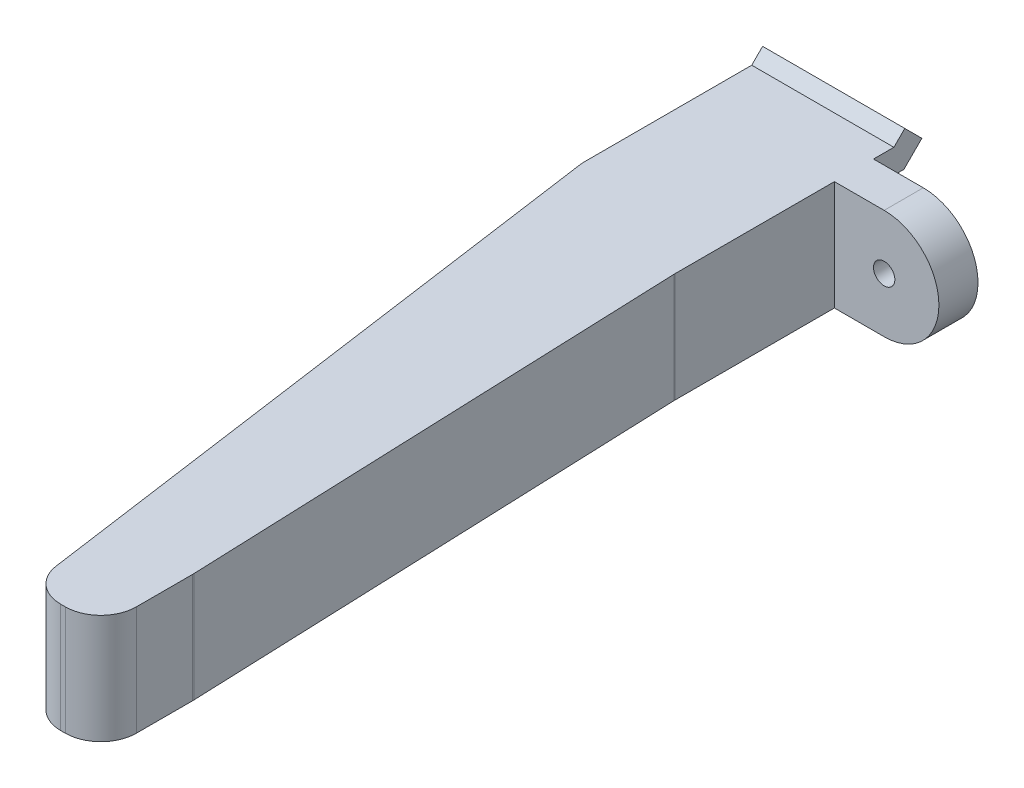
ISO-10303-21;
HEADER;
FILE_DESCRIPTION(('STEP AP214'),'2;1');
FILE_NAME('part.step','',(''),(''),'','','');
FILE_SCHEMA(('AUTOMOTIVE_DESIGN { 1 0 10303 214 1 1 1 1 }'));
ENDSEC;
DATA;
#1=APPLICATION_CONTEXT('core data for automotive mechanical design processes');
#2=APPLICATION_PROTOCOL_DEFINITION('international standard','automotive_design',2000,#1);
#3=PRODUCT_CONTEXT('',#1,'mechanical');
#4=PRODUCT('Part','Part','',(#3));
#5=PRODUCT_RELATED_PRODUCT_CATEGORY('part','',(#4));
#6=PRODUCT_DEFINITION_FORMATION('','',#4);
#7=PRODUCT_DEFINITION_CONTEXT('part definition',#1,'design');
#8=PRODUCT_DEFINITION('design','',#6,#7);
#9=PRODUCT_DEFINITION_SHAPE('','',#8);
#10=(LENGTH_UNIT() NAMED_UNIT(*) SI_UNIT(.MILLI.,.METRE.));
#11=(NAMED_UNIT(*) PLANE_ANGLE_UNIT() SI_UNIT($,.RADIAN.));
#12=(NAMED_UNIT(*) SI_UNIT($,.STERADIAN.) SOLID_ANGLE_UNIT());
#13=UNCERTAINTY_MEASURE_WITH_UNIT(LENGTH_MEASURE(1.E-05),#10,'distance_accuracy_value','');
#14=(GEOMETRIC_REPRESENTATION_CONTEXT(3) GLOBAL_UNCERTAINTY_ASSIGNED_CONTEXT((#13)) GLOBAL_UNIT_ASSIGNED_CONTEXT((#10,
#11,#12)) REPRESENTATION_CONTEXT('',''));
#15=CARTESIAN_POINT('',(0.,0.,0.));
#16=DIRECTION('',(0.,0.,1.));
#17=DIRECTION('',(1.,0.,0.));
#18=AXIS2_PLACEMENT_3D('',#15,#16,#17);
#19=CARTESIAN_POINT('',(5.,-5.8181568544759,5.));
#20=DIRECTION('',(-1.,0.,0.));
#21=DIRECTION('',(0.,0.,1.));
#22=AXIS2_PLACEMENT_3D('',#19,#20,#21);
#23=PLANE('',#22);
#24=DIRECTION('',(0.,0.,1.));
#25=VECTOR('',#24,1.);
#26=CARTESIAN_POINT('',(5.,5.77025558498248,-0.150000000000413));
#27=LINE('',#26,#25);
#28=CARTESIAN_POINT('',(5.,5.77025558498248,-1.43370490961019));
#29=VERTEX_POINT('',#28);
#30=CARTESIAN_POINT('',(5.,5.77025558498248,0.));
#31=VERTEX_POINT('',#30);
#32=EDGE_CURVE('E325',#29,#31,#27,.T.);
#33=ORIENTED_EDGE('',*,*,#32,.T.);
#34=DIRECTION('',(0.,-1.,0.));
#35=VECTOR('',#34,1.);
#36=CARTESIAN_POINT('',(5.,-1.92974441501744,0.));
#37=LINE('',#36,#35);
#38=CARTESIAN_POINT('',(5.,4.07025558498248,0.));
#39=VERTEX_POINT('',#38);
#40=EDGE_CURVE('E213',#31,#39,#37,.T.);
#41=ORIENTED_EDGE('',*,*,#40,.T.);
#42=DIRECTION('',(0.,0.,-1.));
#43=VECTOR('',#42,1.);
#44=CARTESIAN_POINT('',(5.,4.07025558498249,0.));
#45=LINE('',#44,#43);
#46=CARTESIAN_POINT('',(5.,4.07025558498249,-2.13786796564445));
#47=VERTEX_POINT('',#46);
#48=EDGE_CURVE('E298',#39,#47,#45,.T.);
#49=ORIENTED_EDGE('',*,*,#48,.T.);
#50=DIRECTION('',(0.,0.707106781186548,-0.707106781186547));
#51=VECTOR('',#50,1.);
#52=CARTESIAN_POINT('',(5.,5.33446914735558,-3.40208152801754));
#53=LINE('',#52,#51);
#54=CARTESIAN_POINT('',(5.,5.33446914735558,-3.40208152801754));
#55=VERTEX_POINT('',#54);
#56=EDGE_CURVE('E296',#47,#55,#53,.T.);
#57=ORIENTED_EDGE('',*,*,#56,.T.);
#58=DIRECTION('',(0.,0.707106781186546,0.707106781186549));
#59=VECTOR('',#58,1.);
#60=CARTESIAN_POINT('',(5.,6.53655067537271,-2.20000000000041));
#61=LINE('',#60,#59);
#62=CARTESIAN_POINT('',(5.,6.53655067537271,-2.20000000000041));
#63=VERTEX_POINT('',#62);
#64=EDGE_CURVE('E293',#55,#63,#61,.T.);
#65=ORIENTED_EDGE('',*,*,#64,.T.);
#66=DIRECTION('',(0.,-0.707106781186548,0.707106781186547));
#67=VECTOR('',#66,1.);
#68=CARTESIAN_POINT('',(5.,5.77025558498248,-1.43370490961019));
#69=LINE('',#68,#67);
#70=EDGE_CURVE('E291',#63,#29,#69,.T.);
#71=ORIENTED_EDGE('',*,*,#70,.T.);
#72=EDGE_LOOP('',(#33,#41,#49,#57,#65,#71));
#73=FACE_BOUND('',#72,.T.);
#74=ADVANCED_FACE('F35',(#73),#23,.F.);
#75=DIRECTION('',(0.,0.,1.));
#76=VECTOR('',#75,1.);
#77=CARTESIAN_POINT('',(5.,-0.229744415017516,-0.150000000000413));
#78=LINE('',#77,#76);
#79=CARTESIAN_POINT('',(5.,-0.229744415017516,-1.43370490961019));
#80=VERTEX_POINT('',#79);
#81=CARTESIAN_POINT('',(5.,-0.229744415017517,0.));
#82=VERTEX_POINT('',#81);
#83=EDGE_CURVE('E210',#80,#82,#78,.T.);
#84=ORIENTED_EDGE('',*,*,#83,.T.);
#85=CARTESIAN_POINT('',(5.,-1.92974441501744,0.));
#86=VERTEX_POINT('',#85);
#87=EDGE_CURVE('E207',#82,#86,#37,.T.);
#88=ORIENTED_EDGE('',*,*,#87,.T.);
#89=DIRECTION('',(0.,0.,-1.));
#90=VECTOR('',#89,1.);
#91=CARTESIAN_POINT('',(5.,-1.92974441501751,-0.150000000000413));
#92=LINE('',#91,#90);
#93=CARTESIAN_POINT('',(5.,-1.92974441501751,-2.13786796564445));
#94=VERTEX_POINT('',#93);
#95=EDGE_CURVE('E190',#86,#94,#92,.T.);
#96=ORIENTED_EDGE('',*,*,#95,.T.);
#97=DIRECTION('',(0.,0.707106781186549,-0.707106781186546));
#98=VECTOR('',#97,1.);
#99=CARTESIAN_POINT('',(5.,-0.66553085264442,-3.40208152801754));
#100=LINE('',#99,#98);
#101=CARTESIAN_POINT('',(5.,-0.66553085264442,-3.40208152801754));
#102=VERTEX_POINT('',#101);
#103=EDGE_CURVE('E203',#94,#102,#100,.T.);
#104=ORIENTED_EDGE('',*,*,#103,.T.);
#105=DIRECTION('',(0.,0.707106781186548,0.707106781186548));
#106=VECTOR('',#105,1.);
#107=CARTESIAN_POINT('',(5.,0.53655067537271,-2.20000000000041));
#108=LINE('',#107,#106);
#109=CARTESIAN_POINT('',(5.,0.53655067537271,-2.20000000000041));
#110=VERTEX_POINT('',#109);
#111=EDGE_CURVE('E264',#102,#110,#108,.T.);
#112=ORIENTED_EDGE('',*,*,#111,.T.);
#113=DIRECTION('',(0.,-0.707106781186546,0.707106781186549));
#114=VECTOR('',#113,1.);
#115=CARTESIAN_POINT('',(5.,-0.229744415017516,-1.43370490961019));
#116=LINE('',#115,#114);
#117=EDGE_CURVE('E262',#110,#80,#116,.T.);
#118=ORIENTED_EDGE('',*,*,#117,.T.);
#119=EDGE_LOOP('',(#84,#88,#96,#104,#112,#118));
#120=FACE_BOUND('',#119,.T.);
#121=ADVANCED_FACE('F208',(#120),#23,.F.);
#122=CARTESIAN_POINT('',(5.,5.77025558498248,2.75000000000001));
#123=VERTEX_POINT('',#122);
#124=CARTESIAN_POINT('',(5.,5.77025558498248,13.9519905196735));
#125=VERTEX_POINT('',#124);
#126=EDGE_CURVE('E300',#123,#125,#27,.T.);
#127=ORIENTED_EDGE('',*,*,#126,.T.);
#128=DIRECTION('',(0.,1.,0.));
#129=VECTOR('',#128,1.);
#130=CARTESIAN_POINT('',(5.,-5.8181568544759,13.9519905196735));
#131=LINE('',#130,#129);
#132=CARTESIAN_POINT('',(5.,-1.92974441501749,13.9519905196735));
#133=VERTEX_POINT('',#132);
#134=EDGE_CURVE('E350',#125,#133,#131,.F.);
#135=ORIENTED_EDGE('',*,*,#134,.T.);
#136=CARTESIAN_POINT('',(5.,-1.92974441501751,2.75000000000001));
#137=VERTEX_POINT('',#136);
#138=EDGE_CURVE('E202',#133,#137,#92,.T.);
#139=ORIENTED_EDGE('',*,*,#138,.T.);
#140=DIRECTION('',(0.,-1.,0.));
#141=VECTOR('',#140,1.);
#142=CARTESIAN_POINT('',(5.,-1.92974441501744,2.75000000000001));
#143=LINE('',#142,#141);
#144=EDGE_CURVE('E373',#123,#137,#143,.T.);
#145=ORIENTED_EDGE('',*,*,#144,.F.);
#146=EDGE_LOOP('',(#127,#135,#139,#145));
#147=FACE_BOUND('',#146,.T.);
#148=ADVANCED_FACE('F370',(#147),#23,.F.);
#149=CARTESIAN_POINT('',(-5.,-5.8181568544759,5.));
#150=DIRECTION('',(1.,0.,0.));
#151=DIRECTION('',(0.,0.,-1.));
#152=AXIS2_PLACEMENT_3D('',#149,#150,#151);
#153=PLANE('',#152);
#154=DIRECTION('',(0.,0.,1.));
#155=VECTOR('',#154,1.);
#156=CARTESIAN_POINT('',(-5.,-1.92974441501751,-0.150000000000413));
#157=LINE('',#156,#155);
#158=CARTESIAN_POINT('',(-5.,-1.92974441501751,-2.13786796564445));
#159=VERTEX_POINT('',#158);
#160=CARTESIAN_POINT('',(-5.,-1.9297444150175,10.5));
#161=VERTEX_POINT('',#160);
#162=EDGE_CURVE('E278',#159,#161,#157,.T.);
#163=ORIENTED_EDGE('',*,*,#162,.T.);
#164=DIRECTION('',(0.,1.,0.));
#165=VECTOR('',#164,1.);
#166=CARTESIAN_POINT('',(-5.,-53.8851870944869,10.5));
#167=LINE('',#166,#165);
#168=CARTESIAN_POINT('',(-5.,5.77025558498248,10.5));
#169=VERTEX_POINT('',#168);
#170=EDGE_CURVE('E257',#161,#169,#167,.T.);
#171=ORIENTED_EDGE('',*,*,#170,.T.);
#172=DIRECTION('',(0.,0.,-1.));
#173=VECTOR('',#172,1.);
#174=CARTESIAN_POINT('',(-5.,5.77025558498248,-0.150000000000413));
#175=LINE('',#174,#173);
#176=CARTESIAN_POINT('',(-5.,5.77025558498248,-1.43370490961019));
#177=VERTEX_POINT('',#176);
#178=EDGE_CURVE('E290',#169,#177,#175,.T.);
#179=ORIENTED_EDGE('',*,*,#178,.T.);
#180=DIRECTION('',(0.,0.707106781186548,-0.707106781186547));
#181=VECTOR('',#180,1.);
#182=CARTESIAN_POINT('',(-5.,5.77025558498248,-1.43370490961019));
#183=LINE('',#182,#181);
#184=CARTESIAN_POINT('',(-5.,6.53655067537271,-2.20000000000041));
#185=VERTEX_POINT('',#184);
#186=EDGE_CURVE('E303',#177,#185,#183,.T.);
#187=ORIENTED_EDGE('',*,*,#186,.T.);
#188=DIRECTION('',(0.,-0.707106781186546,-0.707106781186549));
#189=VECTOR('',#188,1.);
#190=CARTESIAN_POINT('',(-5.,6.53655067537271,-2.20000000000041));
#191=LINE('',#190,#189);
#192=CARTESIAN_POINT('',(-5.,5.33446914735558,-3.40208152801754));
#193=VERTEX_POINT('',#192);
#194=EDGE_CURVE('E306',#185,#193,#191,.T.);
#195=ORIENTED_EDGE('',*,*,#194,.T.);
#196=DIRECTION('',(0.,-0.707106781186548,0.707106781186547));
#197=VECTOR('',#196,1.);
#198=CARTESIAN_POINT('',(-5.,5.33446914735558,-3.40208152801754));
#199=LINE('',#198,#197);
#200=CARTESIAN_POINT('',(-5.,4.07025558498249,-2.13786796564445));
#201=VERTEX_POINT('',#200);
#202=EDGE_CURVE('E309',#193,#201,#199,.T.);
#203=ORIENTED_EDGE('',*,*,#202,.T.);
#204=DIRECTION('',(0.,0.,1.));
#205=VECTOR('',#204,1.);
#206=CARTESIAN_POINT('',(-5.,4.07025558498249,0.));
#207=LINE('',#206,#205);
#208=CARTESIAN_POINT('',(-5.,4.07025558498249,0.));
#209=VERTEX_POINT('',#208);
#210=EDGE_CURVE('E312',#201,#209,#207,.T.);
#211=ORIENTED_EDGE('',*,*,#210,.T.);
#212=DIRECTION('',(0.,-1.,0.));
#213=VECTOR('',#212,1.);
#214=CARTESIAN_POINT('',(-5.,-5.8181568544759,0.));
#215=LINE('',#214,#213);
#216=CARTESIAN_POINT('',(-5.,-0.229744415017516,0.));
#217=VERTEX_POINT('',#216);
#218=EDGE_CURVE('E327',#209,#217,#215,.T.);
#219=ORIENTED_EDGE('',*,*,#218,.T.);
#220=DIRECTION('',(0.,0.,-1.));
#221=VECTOR('',#220,1.);
#222=CARTESIAN_POINT('',(-5.,-0.229744415017516,-0.150000000000413));
#223=LINE('',#222,#221);
#224=CARTESIAN_POINT('',(-5.,-0.229744415017516,-1.43370490961019));
#225=VERTEX_POINT('',#224);
#226=EDGE_CURVE('E254',#217,#225,#223,.T.);
#227=ORIENTED_EDGE('',*,*,#226,.T.);
#228=DIRECTION('',(0.,0.707106781186546,-0.707106781186549));
#229=VECTOR('',#228,1.);
#230=CARTESIAN_POINT('',(-5.,-0.229744415017516,-1.43370490961019));
#231=LINE('',#230,#229);
#232=CARTESIAN_POINT('',(-5.,0.53655067537271,-2.20000000000041));
#233=VERTEX_POINT('',#232);
#234=EDGE_CURVE('E269',#225,#233,#231,.T.);
#235=ORIENTED_EDGE('',*,*,#234,.T.);
#236=DIRECTION('',(0.,-0.707106781186548,-0.707106781186548));
#237=VECTOR('',#236,1.);
#238=CARTESIAN_POINT('',(-5.,0.53655067537271,-2.20000000000041));
#239=LINE('',#238,#237);
#240=CARTESIAN_POINT('',(-5.,-0.66553085264442,-3.40208152801754));
#241=VERTEX_POINT('',#240);
#242=EDGE_CURVE('E272',#233,#241,#239,.T.);
#243=ORIENTED_EDGE('',*,*,#242,.T.);
#244=DIRECTION('',(0.,-0.707106781186549,0.707106781186546));
#245=VECTOR('',#244,1.);
#246=CARTESIAN_POINT('',(-5.,-0.66553085264442,-3.40208152801754));
#247=LINE('',#246,#245);
#248=EDGE_CURVE('E275',#241,#159,#247,.T.);
#249=ORIENTED_EDGE('',*,*,#248,.T.);
#250=EDGE_LOOP('',(#163,#171,#179,#187,#195,#203,#211,#219,#227,#235,#243,#249));
#251=FACE_BOUND('',#250,.T.);
#252=ADVANCED_FACE('F403',(#251),#153,.F.);
#253=CARTESIAN_POINT('',(0.,0.,0.));
#254=DIRECTION('',(0.,0.,-1.));
#255=DIRECTION('',(-1.,0.,0.));
#256=AXIS2_PLACEMENT_3D('',#253,#254,#255);
#257=PLANE('',#256);
#258=DIRECTION('',(-1.,0.,0.));
#259=VECTOR('',#258,1.);
#260=CARTESIAN_POINT('',(9.20199597764695,-0.229744415017516,0.));
#261=LINE('',#260,#259);
#262=EDGE_CURVE('E280',#82,#217,#261,.T.);
#263=ORIENTED_EDGE('',*,*,#262,.T.);
#264=ORIENTED_EDGE('',*,*,#218,.F.);
#265=DIRECTION('',(-1.,0.,0.));
#266=VECTOR('',#265,1.);
#267=CARTESIAN_POINT('',(9.20199597764695,4.07025558498249,0.));
#268=LINE('',#267,#266);
#269=EDGE_CURVE('E294',#39,#209,#268,.T.);
#270=ORIENTED_EDGE('',*,*,#269,.F.);
#271=ORIENTED_EDGE('',*,*,#40,.F.);
#272=DIRECTION('',(-1.,0.,0.));
#273=VECTOR('',#272,1.);
#274=CARTESIAN_POINT('',(5.,5.77025558498248,0.));
#275=LINE('',#274,#273);
#276=CARTESIAN_POINT('',(8.5,5.77025558498248,0.));
#277=VERTEX_POINT('',#276);
#278=EDGE_CURVE('E222',#277,#31,#275,.T.);
#279=ORIENTED_EDGE('',*,*,#278,.F.);
#280=CARTESIAN_POINT('',(8.5,1.92025558498252,0.));
#281=DIRECTION('',(0.,0.,1.));
#282=DIRECTION('',(-1.,0.,0.));
#283=AXIS2_PLACEMENT_3D('',#280,#281,#282);
#284=CIRCLE('',#283,3.84999999999996);
#285=CARTESIAN_POINT('',(8.5,-1.92974441501744,0.));
#286=VERTEX_POINT('',#285);
#287=EDGE_CURVE('E220',#286,#277,#284,.T.);
#288=ORIENTED_EDGE('',*,*,#287,.F.);
#289=DIRECTION('',(1.,0.,0.));
#290=VECTOR('',#289,1.);
#291=CARTESIAN_POINT('',(8.5,-1.92974441501744,0.));
#292=LINE('',#291,#290);
#293=EDGE_CURVE('E196',#86,#286,#292,.T.);
#294=ORIENTED_EDGE('',*,*,#293,.F.);
#295=ORIENTED_EDGE('',*,*,#87,.F.);
#296=EDGE_LOOP('',(#263,#264,#270,#271,#279,#288,#294,#295));
#297=FACE_BOUND('',#296,.T.);
#298=CARTESIAN_POINT('',(8.5,1.92025558498252,0.));
#299=DIRECTION('',(0.,0.,1.));
#300=DIRECTION('',(1.,0.,0.));
#301=AXIS2_PLACEMENT_3D('',#298,#299,#300);
#302=CIRCLE('',#301,0.749999999989118);
#303=CARTESIAN_POINT('',(9.24999999998912,1.92025558498252,0.));
#304=VERTEX_POINT('',#303);
#305=EDGE_CURVE('E214',#304,#304,#302,.T.);
#306=ORIENTED_EDGE('',*,*,#305,.T.);
#307=EDGE_LOOP('',(#306));
#308=FACE_BOUND('',#307,.T.);
#309=ADVANCED_FACE('F216',(#297,#308),#257,.T.);
#310=CARTESIAN_POINT('',(9.20199597764695,4.07025558498249,0.));
#311=DIRECTION('',(0.,-1.,0.));
#312=DIRECTION('',(0.,0.,-1.));
#313=AXIS2_PLACEMENT_3D('',#310,#311,#312);
#314=PLANE('',#313);
#315=ORIENTED_EDGE('',*,*,#48,.F.);
#316=ORIENTED_EDGE('',*,*,#269,.T.);
#317=ORIENTED_EDGE('',*,*,#210,.F.);
#318=DIRECTION('',(-1.,0.,0.));
#319=VECTOR('',#318,1.);
#320=CARTESIAN_POINT('',(9.20199597764695,4.07025558498249,-2.13786796564445));
#321=LINE('',#320,#319);
#322=EDGE_CURVE('E318',#47,#201,#321,.T.);
#323=ORIENTED_EDGE('',*,*,#322,.F.);
#324=EDGE_LOOP('',(#315,#316,#317,#323));
#325=FACE_BOUND('',#324,.T.);
#326=ADVANCED_FACE('F425',(#325),#314,.T.);
#327=CARTESIAN_POINT('',(9.20199597764695,5.33446914735558,-3.40208152801754));
#328=DIRECTION('',(0.,-0.707106781186547,-0.707106781186548));
#329=DIRECTION('',(0.,0.707106781186548,-0.707106781186547));
#330=AXIS2_PLACEMENT_3D('',#327,#328,#329);
#331=PLANE('',#330);
#332=ORIENTED_EDGE('',*,*,#56,.F.);
#333=ORIENTED_EDGE('',*,*,#322,.T.);
#334=ORIENTED_EDGE('',*,*,#202,.F.);
#335=DIRECTION('',(-1.,0.,0.));
#336=VECTOR('',#335,1.);
#337=CARTESIAN_POINT('',(9.20199597764695,5.33446914735558,-3.40208152801754));
#338=LINE('',#337,#336);
#339=EDGE_CURVE('E320',#55,#193,#338,.T.);
#340=ORIENTED_EDGE('',*,*,#339,.F.);
#341=EDGE_LOOP('',(#332,#333,#334,#340));
#342=FACE_BOUND('',#341,.T.);
#343=ADVANCED_FACE('F483',(#342),#331,.T.);
#344=CARTESIAN_POINT('',(9.20199597764695,6.53655067537271,-2.20000000000041));
#345=DIRECTION('',(0.,0.707106781186549,-0.707106781186546));
#346=DIRECTION('',(0.,0.707106781186546,0.707106781186549));
#347=AXIS2_PLACEMENT_3D('',#344,#345,#346);
#348=PLANE('',#347);
#349=ORIENTED_EDGE('',*,*,#64,.F.);
#350=ORIENTED_EDGE('',*,*,#339,.T.);
#351=ORIENTED_EDGE('',*,*,#194,.F.);
#352=DIRECTION('',(-1.,0.,0.));
#353=VECTOR('',#352,1.);
#354=CARTESIAN_POINT('',(9.20199597764695,6.53655067537271,-2.20000000000041));
#355=LINE('',#354,#353);
#356=EDGE_CURVE('E322',#63,#185,#355,.T.);
#357=ORIENTED_EDGE('',*,*,#356,.F.);
#358=EDGE_LOOP('',(#349,#350,#351,#357));
#359=FACE_BOUND('',#358,.T.);
#360=ADVANCED_FACE('F479',(#359),#348,.T.);
#361=CARTESIAN_POINT('',(9.20199597764695,5.77025558498248,-1.43370490961019));
#362=DIRECTION('',(0.,0.707106781186547,0.707106781186548));
#363=DIRECTION('',(0.,-0.707106781186548,0.707106781186547));
#364=AXIS2_PLACEMENT_3D('',#361,#362,#363);
#365=PLANE('',#364);
#366=ORIENTED_EDGE('',*,*,#70,.F.);
#367=ORIENTED_EDGE('',*,*,#356,.T.);
#368=ORIENTED_EDGE('',*,*,#186,.F.);
#369=DIRECTION('',(-1.,0.,0.));
#370=VECTOR('',#369,1.);
#371=CARTESIAN_POINT('',(9.20199597764695,5.77025558498248,-1.43370490961019));
#372=LINE('',#371,#370);
#373=EDGE_CURVE('E315',#29,#177,#372,.T.);
#374=ORIENTED_EDGE('',*,*,#373,.F.);
#375=EDGE_LOOP('',(#366,#367,#368,#374));
#376=FACE_BOUND('',#375,.T.);
#377=ADVANCED_FACE('F476',(#376),#365,.T.);
#378=CARTESIAN_POINT('',(9.20199597764695,5.77025558498248,-0.150000000000413));
#379=DIRECTION('',(0.,1.,0.));
#380=DIRECTION('',(0.,0.,1.));
#381=AXIS2_PLACEMENT_3D('',#378,#379,#380);
#382=PLANE('',#381);
#383=DIRECTION('',(0.,0.,-1.));
#384=VECTOR('',#383,1.);
#385=CARTESIAN_POINT('',(6.35244572854812,5.77025558498248,55.7));
#386=LINE('',#385,#384);
#387=CARTESIAN_POINT('',(6.35244572854812,5.77025558498248,53.2));
#388=VERTEX_POINT('',#387);
#389=CARTESIAN_POINT('',(6.35244572854812,5.77025558498248,49.2480094803265));
#390=VERTEX_POINT('',#389);
#391=EDGE_CURVE('E244',#388,#390,#386,.T.);
#392=ORIENTED_EDGE('',*,*,#391,.T.);
#393=CARTESIAN_POINT('',(3.85244572854812,5.77025558498248,49.2480094803265));
#394=DIRECTION('',(0.,1.,0.));
#395=DIRECTION('',(0.,0.,1.));
#396=AXIS2_PLACEMENT_3D('',#393,#394,#395);
#397=CIRCLE('',#396,2.5);
#398=CARTESIAN_POINT('',(6.35060248015067,5.77025558498248,49.1520259170325));
#399=VERTEX_POINT('',#398);
#400=EDGE_CURVE('E339',#390,#399,#397,.T.);
#401=ORIENTED_EDGE('',*,*,#400,.T.);
#402=DIRECTION('',(-0.0383934253175967,0.,-0.999262700641019));
#403=VECTOR('',#402,1.);
#404=CARTESIAN_POINT('',(5.,5.77025558498248,14.));
#405=LINE('',#404,#403);
#406=CARTESIAN_POINT('',(5.00184324839745,5.77025558498248,14.0479740829675));
#407=VERTEX_POINT('',#406);
#408=EDGE_CURVE('E241',#399,#407,#405,.T.);
#409=ORIENTED_EDGE('',*,*,#408,.T.);
#410=CARTESIAN_POINT('',(7.5,5.77025558498248,13.9519905196735));
#411=DIRECTION('',(0.,1.,0.));
#412=DIRECTION('',(0.,0.,1.));
#413=AXIS2_PLACEMENT_3D('',#410,#411,#412);
#414=CIRCLE('',#413,2.5);
#415=EDGE_CURVE('E43',#407,#125,#414,.F.);
#416=ORIENTED_EDGE('',*,*,#415,.T.);
#417=ORIENTED_EDGE('',*,*,#126,.F.);
#418=DIRECTION('',(-1.,0.,0.));
#419=VECTOR('',#418,1.);
#420=CARTESIAN_POINT('',(5.,5.77025558498248,2.75000000000001));
#421=LINE('',#420,#419);
#422=CARTESIAN_POINT('',(8.5,5.77025558498248,2.75000000000002));
#423=VERTEX_POINT('',#422);
#424=EDGE_CURVE('E236',#423,#123,#421,.T.);
#425=ORIENTED_EDGE('',*,*,#424,.F.);
#426=DIRECTION('',(0.,0.,-1.));
#427=VECTOR('',#426,1.);
#428=CARTESIAN_POINT('',(8.5,5.77025558498248,13.3948344280218));
#429=LINE('',#428,#427);
#430=EDGE_CURVE('E228',#423,#277,#429,.T.);
#431=ORIENTED_EDGE('',*,*,#430,.T.);
#432=ORIENTED_EDGE('',*,*,#278,.T.);
#433=ORIENTED_EDGE('',*,*,#32,.F.);
#434=ORIENTED_EDGE('',*,*,#373,.T.);
#435=ORIENTED_EDGE('',*,*,#178,.F.);
#436=DIRECTION('',(0.139173100960066,0.,0.99026806874157));
#437=VECTOR('',#436,1.);
#438=CARTESIAN_POINT('',(-5.,5.77025558498248,10.5));
#439=LINE('',#438,#437);
#440=CARTESIAN_POINT('',(1.04999240123476,5.77025558498248,53.5479327524002));
#441=VERTEX_POINT('',#440);
#442=EDGE_CURVE('E237',#169,#441,#439,.T.);
#443=ORIENTED_EDGE('',*,*,#442,.T.);
#444=CARTESIAN_POINT('',(3.52566257308868,5.77025558498248,53.2));
#445=DIRECTION('',(0.,1.,0.));
#446=DIRECTION('',(0.,0.,1.));
#447=AXIS2_PLACEMENT_3D('',#444,#445,#446);
#448=CIRCLE('',#447,2.5);
#449=CARTESIAN_POINT('',(3.52566257308868,5.77025558498248,55.7));
#450=VERTEX_POINT('',#449);
#451=EDGE_CURVE('E335',#441,#450,#448,.T.);
#452=ORIENTED_EDGE('',*,*,#451,.T.);
#453=DIRECTION('',(1.,0.,0.));
#454=VECTOR('',#453,1.);
#455=CARTESIAN_POINT('',(1.35244572854812,5.77025558498248,55.7));
#456=LINE('',#455,#454);
#457=CARTESIAN_POINT('',(3.85244572854812,5.77025558498248,55.7));
#458=VERTEX_POINT('',#457);
#459=EDGE_CURVE('E232',#450,#458,#456,.T.);
#460=ORIENTED_EDGE('',*,*,#459,.T.);
#461=CARTESIAN_POINT('',(3.85244572854812,5.77025558498248,53.2));
#462=DIRECTION('',(0.,1.,0.));
#463=DIRECTION('',(0.,0.,1.));
#464=AXIS2_PLACEMENT_3D('',#461,#462,#463);
#465=CIRCLE('',#464,2.5);
#466=EDGE_CURVE('E337',#458,#388,#465,.T.);
#467=ORIENTED_EDGE('',*,*,#466,.T.);
#468=EDGE_LOOP('',(#392,#401,#409,#416,#417,#425,#431,#432,#433,#434,#435,#443,#452,#460,#467));
#469=FACE_BOUND('',#468,.T.);
#470=ADVANCED_FACE('F362',(#469),#382,.T.);
#471=CARTESIAN_POINT('',(9.20199597764695,-1.92974441501751,-0.150000000000413));
#472=DIRECTION('',(0.,-1.,0.));
#473=DIRECTION('',(0.,0.,-1.));
#474=AXIS2_PLACEMENT_3D('',#471,#472,#473);
#475=PLANE('',#474);
#476=DIRECTION('',(-0.0383934253175967,0.,-0.999262700641019));
#477=VECTOR('',#476,1.);
#478=CARTESIAN_POINT('',(5.,-1.9297444150175,13.9999999999999));
#479=LINE('',#478,#477);
#480=CARTESIAN_POINT('',(6.35060248015067,-1.92974441501745,49.1520259170325));
#481=VERTEX_POINT('',#480);
#482=CARTESIAN_POINT('',(5.00184324839745,-1.9297444150175,14.0479740829675));
#483=VERTEX_POINT('',#482);
#484=EDGE_CURVE('E251',#481,#483,#479,.T.);
#485=ORIENTED_EDGE('',*,*,#484,.F.);
#486=CARTESIAN_POINT('',(3.85244572854812,-1.92974441501745,49.2480094803265));
#487=DIRECTION('',(0.,-1.,0.));
#488=DIRECTION('',(0.,0.,-1.));
#489=AXIS2_PLACEMENT_3D('',#486,#487,#488);
#490=CIRCLE('',#489,2.5);
#491=CARTESIAN_POINT('',(6.35244572854812,-1.92974441501744,49.2480094803265));
#492=VERTEX_POINT('',#491);
#493=EDGE_CURVE('E348',#481,#492,#490,.T.);
#494=ORIENTED_EDGE('',*,*,#493,.T.);
#495=DIRECTION('',(0.,0.,-1.));
#496=VECTOR('',#495,1.);
#497=CARTESIAN_POINT('',(6.35244572854812,-1.92974441501743,55.6999999999999));
#498=LINE('',#497,#496);
#499=CARTESIAN_POINT('',(6.35244572854812,-1.92974441501744,53.2));
#500=VERTEX_POINT('',#499);
#501=EDGE_CURVE('E240',#500,#492,#498,.T.);
#502=ORIENTED_EDGE('',*,*,#501,.F.);
#503=CARTESIAN_POINT('',(3.85244572854812,-1.92974441501744,53.2));
#504=DIRECTION('',(0.,-1.,0.));
#505=DIRECTION('',(0.,0.,-1.));
#506=AXIS2_PLACEMENT_3D('',#503,#504,#505);
#507=CIRCLE('',#506,2.5);
#508=CARTESIAN_POINT('',(3.85244572854812,-1.92974441501743,55.7));
#509=VERTEX_POINT('',#508);
#510=EDGE_CURVE('E56',#500,#509,#507,.T.);
#511=ORIENTED_EDGE('',*,*,#510,.T.);
#512=DIRECTION('',(1.,0.,0.));
#513=VECTOR('',#512,1.);
#514=CARTESIAN_POINT('',(1.35244572854812,-1.92974441501743,55.7));
#515=LINE('',#514,#513);
#516=CARTESIAN_POINT('',(3.52566257308868,-1.92974441501743,55.7));
#517=VERTEX_POINT('',#516);
#518=EDGE_CURVE('E252',#517,#509,#515,.T.);
#519=ORIENTED_EDGE('',*,*,#518,.F.);
#520=CARTESIAN_POINT('',(3.52566257308868,-1.92974441501744,53.2));
#521=DIRECTION('',(0.,-1.,0.));
#522=DIRECTION('',(0.,0.,-1.));
#523=AXIS2_PLACEMENT_3D('',#520,#521,#522);
#524=CIRCLE('',#523,2.5);
#525=CARTESIAN_POINT('',(1.04999240123476,-1.92974441501744,53.5479327524002));
#526=VERTEX_POINT('',#525);
#527=EDGE_CURVE('E50',#517,#526,#524,.T.);
#528=ORIENTED_EDGE('',*,*,#527,.T.);
#529=DIRECTION('',(0.139173100960066,0.,0.99026806874157));
#530=VECTOR('',#529,1.);
#531=CARTESIAN_POINT('',(-5.00000000000001,-1.9297444150175,10.4999999999999));
#532=LINE('',#531,#530);
#533=EDGE_CURVE('E255',#161,#526,#532,.T.);
#534=ORIENTED_EDGE('',*,*,#533,.F.);
#535=ORIENTED_EDGE('',*,*,#162,.F.);
#536=DIRECTION('',(-1.,0.,0.));
#537=VECTOR('',#536,1.);
#538=CARTESIAN_POINT('',(9.20199597764695,-1.92974441501751,-2.13786796564445));
#539=LINE('',#538,#537);
#540=EDGE_CURVE('E199',#94,#159,#539,.T.);
#541=ORIENTED_EDGE('',*,*,#540,.F.);
#542=ORIENTED_EDGE('',*,*,#95,.F.);
#543=ORIENTED_EDGE('',*,*,#293,.T.);
#544=DIRECTION('',(0.,0.,-1.));
#545=VECTOR('',#544,1.);
#546=CARTESIAN_POINT('',(8.5,-1.92974441501744,13.3948344280218));
#547=LINE('',#546,#545);
#548=CARTESIAN_POINT('',(8.5,-1.92974441501744,2.75000000000002));
#549=VERTEX_POINT('',#548);
#550=EDGE_CURVE('E230',#549,#286,#547,.T.);
#551=ORIENTED_EDGE('',*,*,#550,.F.);
#552=DIRECTION('',(1.,0.,0.));
#553=VECTOR('',#552,1.);
#554=CARTESIAN_POINT('',(8.5,-1.92974441501744,2.75000000000001));
#555=LINE('',#554,#553);
#556=EDGE_CURVE('E437',#137,#549,#555,.T.);
#557=ORIENTED_EDGE('',*,*,#556,.F.);
#558=ORIENTED_EDGE('',*,*,#138,.F.);
#559=CARTESIAN_POINT('',(7.5,-1.9297444150175,13.9519905196735));
#560=DIRECTION('',(0.,-1.,0.));
#561=DIRECTION('',(0.,0.,-1.));
#562=AXIS2_PLACEMENT_3D('',#559,#560,#561);
#563=CIRCLE('',#562,2.5);
#564=EDGE_CURVE('E11',#133,#483,#563,.F.);
#565=ORIENTED_EDGE('',*,*,#564,.T.);
#566=EDGE_LOOP('',(#485,#494,#502,#511,#519,#528,#534,#535,#541,#542,#543,#551,#557,#558,#565));
#567=FACE_BOUND('',#566,.T.);
#568=ADVANCED_FACE('F193',(#567),#475,.T.);
#569=CARTESIAN_POINT('',(9.20199597764695,-0.66553085264442,-3.40208152801754));
#570=DIRECTION('',(0.,-0.707106781186546,-0.707106781186549));
#571=DIRECTION('',(0.,0.707106781186549,-0.707106781186546));
#572=AXIS2_PLACEMENT_3D('',#569,#570,#571);
#573=PLANE('',#572);
#574=ORIENTED_EDGE('',*,*,#103,.F.);
#575=ORIENTED_EDGE('',*,*,#540,.T.);
#576=ORIENTED_EDGE('',*,*,#248,.F.);
#577=DIRECTION('',(-1.,0.,0.));
#578=VECTOR('',#577,1.);
#579=CARTESIAN_POINT('',(9.20199597764695,-0.66553085264442,-3.40208152801754));
#580=LINE('',#579,#578);
#581=EDGE_CURVE('E282',#102,#241,#580,.T.);
#582=ORIENTED_EDGE('',*,*,#581,.F.);
#583=EDGE_LOOP('',(#574,#575,#576,#582));
#584=FACE_BOUND('',#583,.T.);
#585=ADVANCED_FACE('F407',(#584),#573,.T.);
#586=CARTESIAN_POINT('',(9.20199597764695,0.53655067537271,-2.20000000000041));
#587=DIRECTION('',(0.,0.707106781186548,-0.707106781186548));
#588=DIRECTION('',(0.,0.707106781186548,0.707106781186548));
#589=AXIS2_PLACEMENT_3D('',#586,#587,#588);
#590=PLANE('',#589);
#591=ORIENTED_EDGE('',*,*,#111,.F.);
#592=ORIENTED_EDGE('',*,*,#581,.T.);
#593=ORIENTED_EDGE('',*,*,#242,.F.);
#594=DIRECTION('',(-1.,0.,0.));
#595=VECTOR('',#594,1.);
#596=CARTESIAN_POINT('',(9.20199597764695,0.53655067537271,-2.20000000000041));
#597=LINE('',#596,#595);
#598=EDGE_CURVE('E284',#110,#233,#597,.T.);
#599=ORIENTED_EDGE('',*,*,#598,.F.);
#600=EDGE_LOOP('',(#591,#592,#593,#599));
#601=FACE_BOUND('',#600,.T.);
#602=ADVANCED_FACE('F412',(#601),#590,.T.);
#603=CARTESIAN_POINT('',(9.20199597764695,-0.229744415017516,-1.43370490961019));
#604=DIRECTION('',(0.,0.707106781186549,0.707106781186546));
#605=DIRECTION('',(0.,-0.707106781186546,0.707106781186549));
#606=AXIS2_PLACEMENT_3D('',#603,#604,#605);
#607=PLANE('',#606);
#608=ORIENTED_EDGE('',*,*,#117,.F.);
#609=ORIENTED_EDGE('',*,*,#598,.T.);
#610=ORIENTED_EDGE('',*,*,#234,.F.);
#611=DIRECTION('',(-1.,0.,0.));
#612=VECTOR('',#611,1.);
#613=CARTESIAN_POINT('',(9.20199597764695,-0.229744415017516,-1.43370490961019));
#614=LINE('',#613,#612);
#615=EDGE_CURVE('E286',#80,#225,#614,.T.);
#616=ORIENTED_EDGE('',*,*,#615,.F.);
#617=EDGE_LOOP('',(#608,#609,#610,#616));
#618=FACE_BOUND('',#617,.T.);
#619=ADVANCED_FACE('F415',(#618),#607,.T.);
#620=CARTESIAN_POINT('',(9.20199597764695,-0.229744415017516,-0.150000000000413));
#621=DIRECTION('',(0.,1.,0.));
#622=DIRECTION('',(0.,0.,1.));
#623=AXIS2_PLACEMENT_3D('',#620,#621,#622);
#624=PLANE('',#623);
#625=ORIENTED_EDGE('',*,*,#83,.F.);
#626=ORIENTED_EDGE('',*,*,#615,.T.);
#627=ORIENTED_EDGE('',*,*,#226,.F.);
#628=ORIENTED_EDGE('',*,*,#262,.F.);
#629=EDGE_LOOP('',(#625,#626,#627,#628));
#630=FACE_BOUND('',#629,.T.);
#631=ADVANCED_FACE('F418',(#630),#624,.T.);
#632=CARTESIAN_POINT('',(6.35244572854812,-53.8851870944869,55.7));
#633=DIRECTION('',(1.,0.,0.));
#634=DIRECTION('',(0.,0.,-1.));
#635=AXIS2_PLACEMENT_3D('',#632,#633,#634);
#636=PLANE('',#635);
#637=ORIENTED_EDGE('',*,*,#501,.T.);
#638=DIRECTION('',(0.,1.,0.));
#639=VECTOR('',#638,1.);
#640=CARTESIAN_POINT('',(6.35244572854812,-53.8851870944869,49.2480094803265));
#641=LINE('',#640,#639);
#642=EDGE_CURVE('E332',#492,#390,#641,.T.);
#643=ORIENTED_EDGE('',*,*,#642,.T.);
#644=ORIENTED_EDGE('',*,*,#391,.F.);
#645=DIRECTION('',(0.,1.,0.));
#646=VECTOR('',#645,1.);
#647=CARTESIAN_POINT('',(6.35244572854812,-53.8851870944869,53.2));
#648=LINE('',#647,#646);
#649=EDGE_CURVE('E330',#388,#500,#648,.F.);
#650=ORIENTED_EDGE('',*,*,#649,.T.);
#651=EDGE_LOOP('',(#637,#643,#644,#650));
#652=FACE_BOUND('',#651,.T.);
#653=ADVANCED_FACE('F385',(#652),#636,.T.);
#654=CARTESIAN_POINT('',(5.,-53.8851870944869,14.));
#655=DIRECTION('',(0.999262700641019,0.,-0.0383934253175967));
#656=DIRECTION('',(-0.0383934253175967,0.,-0.999262700641019));
#657=AXIS2_PLACEMENT_3D('',#654,#655,#656);
#658=PLANE('',#657);
#659=ORIENTED_EDGE('',*,*,#408,.F.);
#660=DIRECTION('',(0.,1.,0.));
#661=VECTOR('',#660,1.);
#662=CARTESIAN_POINT('',(6.35060248015067,-53.8851870944869,49.1520259170325));
#663=LINE('',#662,#661);
#664=EDGE_CURVE('E344',#399,#481,#663,.F.);
#665=ORIENTED_EDGE('',*,*,#664,.T.);
#666=ORIENTED_EDGE('',*,*,#484,.T.);
#667=DIRECTION('',(0.,1.,0.));
#668=VECTOR('',#667,1.);
#669=CARTESIAN_POINT('',(5.00184324839745,-53.8851870944869,14.0479740829675));
#670=LINE('',#669,#668);
#671=EDGE_CURVE('E341',#483,#407,#670,.T.);
#672=ORIENTED_EDGE('',*,*,#671,.T.);
#673=EDGE_LOOP('',(#659,#665,#666,#672));
#674=FACE_BOUND('',#673,.T.);
#675=ADVANCED_FACE('F379',(#674),#658,.T.);
#676=CARTESIAN_POINT('',(-5.,-53.8851870944869,10.5));
#677=DIRECTION('',(-0.99026806874157,0.,0.139173100960066));
#678=DIRECTION('',(0.139173100960066,0.,0.99026806874157));
#679=AXIS2_PLACEMENT_3D('',#676,#677,#678);
#680=PLANE('',#679);
#681=ORIENTED_EDGE('',*,*,#533,.T.);
#682=DIRECTION('',(0.,1.,0.));
#683=VECTOR('',#682,1.);
#684=CARTESIAN_POINT('',(1.04999240123476,-53.8851870944869,53.5479327524002));
#685=LINE('',#684,#683);
#686=EDGE_CURVE('E357',#526,#441,#685,.T.);
#687=ORIENTED_EDGE('',*,*,#686,.T.);
#688=ORIENTED_EDGE('',*,*,#442,.F.);
#689=ORIENTED_EDGE('',*,*,#170,.F.);
#690=EDGE_LOOP('',(#681,#687,#688,#689));
#691=FACE_BOUND('',#690,.T.);
#692=ADVANCED_FACE('F399',(#691),#680,.T.);
#693=CARTESIAN_POINT('',(1.35244572854812,-53.8851870944869,55.7));
#694=DIRECTION('',(0.,0.,1.));
#695=DIRECTION('',(1.,0.,0.));
#696=AXIS2_PLACEMENT_3D('',#693,#694,#695);
#697=PLANE('',#696);
#698=ORIENTED_EDGE('',*,*,#518,.T.);
#699=DIRECTION('',(0.,1.,0.));
#700=VECTOR('',#699,1.);
#701=CARTESIAN_POINT('',(3.85244572854812,-53.8851870944869,55.7));
#702=LINE('',#701,#700);
#703=EDGE_CURVE('E354',#509,#458,#702,.T.);
#704=ORIENTED_EDGE('',*,*,#703,.T.);
#705=ORIENTED_EDGE('',*,*,#459,.F.);
#706=DIRECTION('',(0.,1.,0.));
#707=VECTOR('',#706,1.);
#708=CARTESIAN_POINT('',(3.52566257308868,-53.8851870944869,55.7));
#709=LINE('',#708,#707);
#710=EDGE_CURVE('E352',#450,#517,#709,.F.);
#711=ORIENTED_EDGE('',*,*,#710,.T.);
#712=EDGE_LOOP('',(#698,#704,#705,#711));
#713=FACE_BOUND('',#712,.T.);
#714=ADVANCED_FACE('F393',(#713),#697,.T.);
#715=CARTESIAN_POINT('',(8.5,1.92025558498252,13.3948344280218));
#716=DIRECTION('',(0.,0.,-1.));
#717=DIRECTION('',(-1.,0.,0.));
#718=AXIS2_PLACEMENT_3D('',#715,#716,#717);
#719=CYLINDRICAL_SURFACE('',#718,3.84999999999996);
#720=CARTESIAN_POINT('',(8.5,1.92025558498252,2.75000000000001));
#721=DIRECTION('',(0.,0.,1.));
#722=DIRECTION('',(1.,0.,0.));
#723=AXIS2_PLACEMENT_3D('',#720,#721,#722);
#724=CIRCLE('',#723,3.84999999999996);
#725=EDGE_CURVE('E435',#549,#423,#724,.T.);
#726=ORIENTED_EDGE('',*,*,#725,.F.);
#727=ORIENTED_EDGE('',*,*,#550,.T.);
#728=ORIENTED_EDGE('',*,*,#287,.T.);
#729=ORIENTED_EDGE('',*,*,#430,.F.);
#730=EDGE_LOOP('',(#726,#727,#728,#729));
#731=FACE_BOUND('',#730,.T.);
#732=ADVANCED_FACE('F434',(#731),#719,.T.);
#733=CARTESIAN_POINT('',(8.5,1.92025558498252,13.3948344280218));
#734=DIRECTION('',(0.,0.,-1.));
#735=DIRECTION('',(-1.,0.,0.));
#736=AXIS2_PLACEMENT_3D('',#733,#734,#735);
#737=CYLINDRICAL_SURFACE('',#736,0.749999999989118);
#738=ORIENTED_EDGE('',*,*,#305,.F.);
#739=EDGE_LOOP('',(#738));
#740=FACE_BOUND('',#739,.T.);
#741=CARTESIAN_POINT('',(8.5,1.92025558498252,2.75000000000001));
#742=DIRECTION('',(0.,0.,1.));
#743=DIRECTION('',(1.,0.,0.));
#744=AXIS2_PLACEMENT_3D('',#741,#742,#743);
#745=CIRCLE('',#744,0.749999999989118);
#746=CARTESIAN_POINT('',(9.24999999998912,1.92025558498252,2.75000000000001));
#747=VERTEX_POINT('',#746);
#748=EDGE_CURVE('E233',#747,#747,#745,.T.);
#749=ORIENTED_EDGE('',*,*,#748,.T.);
#750=EDGE_LOOP('',(#749));
#751=FACE_BOUND('',#750,.T.);
#752=ADVANCED_FACE('F447',(#740,#751),#737,.F.);
#753=CARTESIAN_POINT('',(0.,0.,2.75000000000001));
#754=DIRECTION('',(0.,0.,1.));
#755=DIRECTION('',(1.,0.,0.));
#756=AXIS2_PLACEMENT_3D('',#753,#754,#755);
#757=PLANE('',#756);
#758=ORIENTED_EDGE('',*,*,#748,.F.);
#759=EDGE_LOOP('',(#758));
#760=FACE_BOUND('',#759,.T.);
#761=ORIENTED_EDGE('',*,*,#424,.T.);
#762=ORIENTED_EDGE('',*,*,#144,.T.);
#763=ORIENTED_EDGE('',*,*,#556,.T.);
#764=ORIENTED_EDGE('',*,*,#725,.T.);
#765=EDGE_LOOP('',(#761,#762,#763,#764));
#766=FACE_BOUND('',#765,.T.);
#767=ADVANCED_FACE('F439',(#760,#766),#757,.T.);
#768=CARTESIAN_POINT('',(3.85244572854812,-53.8851870944869,49.2480094803265));
#769=DIRECTION('',(0.,1.,0.));
#770=DIRECTION('',(0.,0.,1.));
#771=AXIS2_PLACEMENT_3D('',#768,#769,#770);
#772=CYLINDRICAL_SURFACE('',#771,2.5);
#773=ORIENTED_EDGE('',*,*,#493,.F.);
#774=ORIENTED_EDGE('',*,*,#664,.F.);
#775=ORIENTED_EDGE('',*,*,#400,.F.);
#776=ORIENTED_EDGE('',*,*,#642,.F.);
#777=EDGE_LOOP('',(#773,#774,#775,#776));
#778=FACE_BOUND('',#777,.T.);
#779=ADVANCED_FACE('F382',(#778),#772,.T.);
#780=CARTESIAN_POINT('',(7.5,-53.8851870944869,13.9519905196735));
#781=DIRECTION('',(0.,1.,0.));
#782=DIRECTION('',(0.,0.,1.));
#783=AXIS2_PLACEMENT_3D('',#780,#781,#782);
#784=CYLINDRICAL_SURFACE('',#783,2.5);
#785=ORIENTED_EDGE('',*,*,#564,.F.);
#786=ORIENTED_EDGE('',*,*,#134,.F.);
#787=ORIENTED_EDGE('',*,*,#415,.F.);
#788=ORIENTED_EDGE('',*,*,#671,.F.);
#789=EDGE_LOOP('',(#785,#786,#787,#788));
#790=FACE_BOUND('',#789,.T.);
#791=ADVANCED_FACE('F375',(#790),#784,.F.);
#792=CARTESIAN_POINT('',(3.85244572854812,-53.8851870944869,53.2));
#793=DIRECTION('',(0.,1.,0.));
#794=DIRECTION('',(0.,0.,1.));
#795=AXIS2_PLACEMENT_3D('',#792,#793,#794);
#796=CYLINDRICAL_SURFACE('',#795,2.5);
#797=ORIENTED_EDGE('',*,*,#510,.F.);
#798=ORIENTED_EDGE('',*,*,#649,.F.);
#799=ORIENTED_EDGE('',*,*,#466,.F.);
#800=ORIENTED_EDGE('',*,*,#703,.F.);
#801=EDGE_LOOP('',(#797,#798,#799,#800));
#802=FACE_BOUND('',#801,.T.);
#803=ADVANCED_FACE('F389',(#802),#796,.T.);
#804=CARTESIAN_POINT('',(3.52566257308868,-53.8851870944869,53.2));
#805=DIRECTION('',(0.,1.,0.));
#806=DIRECTION('',(0.,0.,1.));
#807=AXIS2_PLACEMENT_3D('',#804,#805,#806);
#808=CYLINDRICAL_SURFACE('',#807,2.5);
#809=ORIENTED_EDGE('',*,*,#527,.F.);
#810=ORIENTED_EDGE('',*,*,#710,.F.);
#811=ORIENTED_EDGE('',*,*,#451,.F.);
#812=ORIENTED_EDGE('',*,*,#686,.F.);
#813=EDGE_LOOP('',(#809,#810,#811,#812));
#814=FACE_BOUND('',#813,.T.);
#815=ADVANCED_FACE('F37',(#814),#808,.T.);
#816=CLOSED_SHELL('',(#74,#121,#148,#252,#309,#326,#343,#360,#377,#470,#568,#585,#602,#619,#631,
#653,#675,#692,#714,#732,#752,#767,#779,#791,#803,#815));
#817=MANIFOLD_SOLID_BREP('B2',#816);
#818=ADVANCED_BREP_SHAPE_REPRESENTATION('',(#18,#817),#14);
#819=SHAPE_DEFINITION_REPRESENTATION(#9,#818);
ENDSEC;
END-ISO-10303-21;
